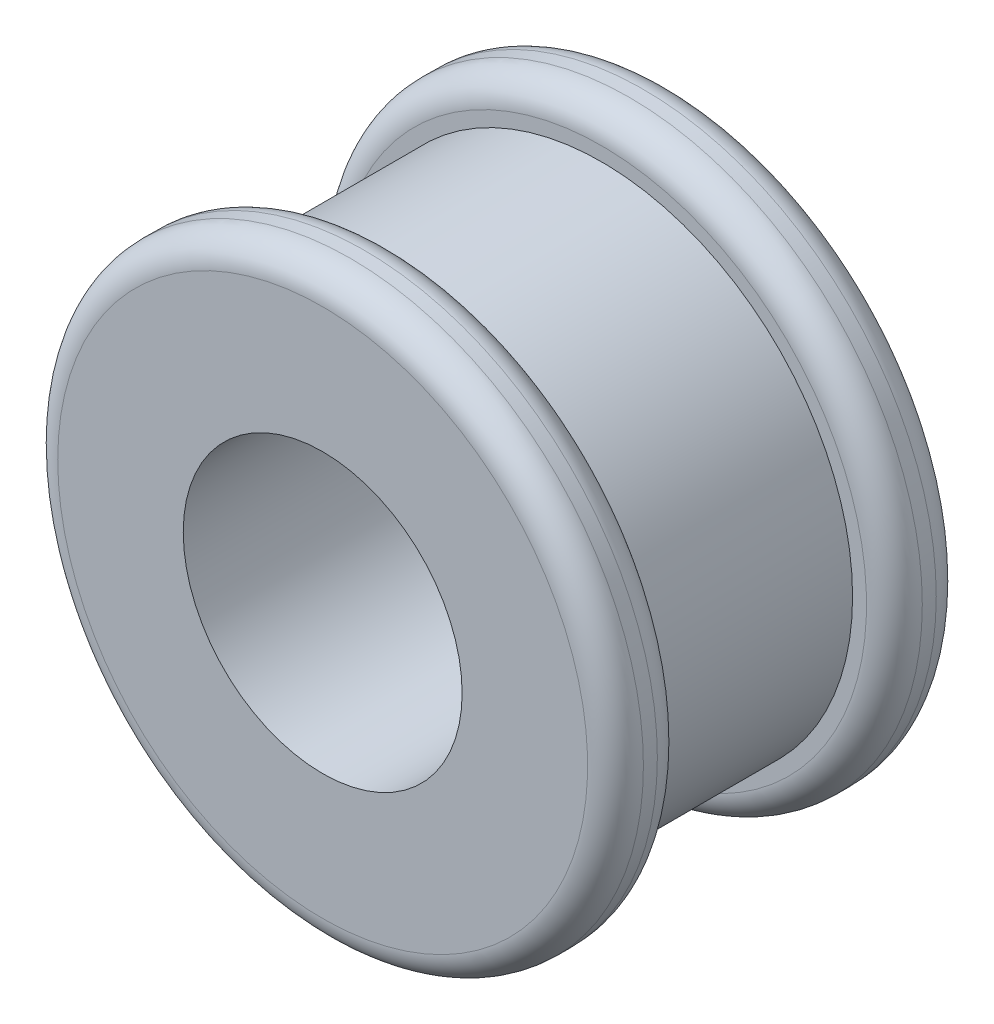
ISO-10303-21;
HEADER;
FILE_DESCRIPTION(('STEP AP214'),'2;1');
FILE_NAME('part.step','',(''),(''),'','','');
FILE_SCHEMA(('AUTOMOTIVE_DESIGN { 1 0 10303 214 1 1 1 1 }'));
ENDSEC;
DATA;
#1=APPLICATION_CONTEXT('core data for automotive mechanical design processes');
#2=APPLICATION_PROTOCOL_DEFINITION('international standard','automotive_design',2000,#1);
#3=PRODUCT_CONTEXT('',#1,'mechanical');
#4=PRODUCT('Part','Part','',(#3));
#5=PRODUCT_RELATED_PRODUCT_CATEGORY('part','',(#4));
#6=PRODUCT_DEFINITION_FORMATION('','',#4);
#7=PRODUCT_DEFINITION_CONTEXT('part definition',#1,'design');
#8=PRODUCT_DEFINITION('design','',#6,#7);
#9=PRODUCT_DEFINITION_SHAPE('','',#8);
#10=(LENGTH_UNIT() NAMED_UNIT(*) SI_UNIT(.MILLI.,.METRE.));
#11=(NAMED_UNIT(*) PLANE_ANGLE_UNIT() SI_UNIT($,.RADIAN.));
#12=(NAMED_UNIT(*) SI_UNIT($,.STERADIAN.) SOLID_ANGLE_UNIT());
#13=UNCERTAINTY_MEASURE_WITH_UNIT(LENGTH_MEASURE(1.E-05),#10,'distance_accuracy_value','');
#14=(GEOMETRIC_REPRESENTATION_CONTEXT(3) GLOBAL_UNCERTAINTY_ASSIGNED_CONTEXT((#13)) GLOBAL_UNIT_ASSIGNED_CONTEXT((#10,
#11,#12)) REPRESENTATION_CONTEXT('',''));
#15=CARTESIAN_POINT('',(0.,0.,0.));
#16=DIRECTION('',(0.,0.,1.));
#17=DIRECTION('',(1.,0.,0.));
#18=AXIS2_PLACEMENT_3D('',#15,#16,#17);
#19=CARTESIAN_POINT('',(0.,21.,0.));
#20=DIRECTION('',(0.,0.,-1.));
#21=DIRECTION('',(-1.,0.,0.));
#22=AXIS2_PLACEMENT_3D('',#19,#20,#21);
#23=PLANE('',#22);
#24=CARTESIAN_POINT('',(0.,0.,0.));
#25=DIRECTION('',(0.,0.,-1.));
#26=DIRECTION('',(-1.,0.,0.));
#27=AXIS2_PLACEMENT_3D('',#24,#25,#26);
#28=CIRCLE('',#27,19.);
#29=CARTESIAN_POINT('',(-19.,0.,0.));
#30=VERTEX_POINT('',#29);
#31=EDGE_CURVE('E10',#30,#30,#28,.F.);
#32=ORIENTED_EDGE('',*,*,#31,.T.);
#33=EDGE_LOOP('',(#32));
#34=FACE_BOUND('',#33,.T.);
#35=CARTESIAN_POINT('',(0.,0.,0.));
#36=DIRECTION('',(0.,0.,1.));
#37=DIRECTION('',(1.,0.,0.));
#38=AXIS2_PLACEMENT_3D('',#35,#36,#37);
#39=CIRCLE('',#38,10.);
#40=CARTESIAN_POINT('',(10.,0.,0.));
#41=VERTEX_POINT('',#40);
#42=EDGE_CURVE('E72',#41,#41,#39,.T.);
#43=ORIENTED_EDGE('',*,*,#42,.F.);
#44=EDGE_LOOP('',(#43));
#45=FACE_BOUND('',#44,.T.);
#46=ADVANCED_FACE('F40',(#34,#45),#23,.F.);
#47=CARTESIAN_POINT('',(0.,0.,0.));
#48=DIRECTION('',(0.,0.,1.));
#49=DIRECTION('',(1.,0.,0.));
#50=AXIS2_PLACEMENT_3D('',#47,#48,#49);
#51=CYLINDRICAL_SURFACE('',#50,10.);
#52=CARTESIAN_POINT('',(0.,0.,-25.));
#53=DIRECTION('',(0.,0.,1.));
#54=DIRECTION('',(1.,0.,0.));
#55=AXIS2_PLACEMENT_3D('',#52,#53,#54);
#56=CIRCLE('',#55,10.);
#57=CARTESIAN_POINT('',(10.,0.,-25.));
#58=VERTEX_POINT('',#57);
#59=EDGE_CURVE('E75',#58,#58,#56,.T.);
#60=ORIENTED_EDGE('',*,*,#59,.F.);
#61=EDGE_LOOP('',(#60));
#62=FACE_BOUND('',#61,.T.);
#63=ORIENTED_EDGE('',*,*,#42,.T.);
#64=EDGE_LOOP('',(#63));
#65=FACE_BOUND('',#64,.T.);
#66=ADVANCED_FACE('F105',(#62,#65),#51,.F.);
#67=CARTESIAN_POINT('',(0.,10.,-25.));
#68=DIRECTION('',(0.,0.,1.));
#69=DIRECTION('',(1.,0.,0.));
#70=AXIS2_PLACEMENT_3D('',#67,#68,#69);
#71=PLANE('',#70);
#72=CARTESIAN_POINT('',(0.,0.,-25.));
#73=DIRECTION('',(0.,0.,1.));
#74=DIRECTION('',(1.,0.,0.));
#75=AXIS2_PLACEMENT_3D('',#72,#73,#74);
#76=CIRCLE('',#75,19.);
#77=CARTESIAN_POINT('',(19.,0.,-25.));
#78=VERTEX_POINT('',#77);
#79=EDGE_CURVE('E63',#78,#78,#76,.F.);
#80=ORIENTED_EDGE('',*,*,#79,.T.);
#81=EDGE_LOOP('',(#80));
#82=FACE_BOUND('',#81,.T.);
#83=ORIENTED_EDGE('',*,*,#59,.T.);
#84=EDGE_LOOP('',(#83));
#85=FACE_BOUND('',#84,.T.);
#86=ADVANCED_FACE('F101',(#82,#85),#71,.F.);
#87=CARTESIAN_POINT('',(0.,0.,0.));
#88=DIRECTION('',(0.,0.,1.));
#89=DIRECTION('',(1.,0.,0.));
#90=AXIS2_PLACEMENT_3D('',#87,#88,#89);
#91=CYLINDRICAL_SURFACE('',#90,21.);
#92=CARTESIAN_POINT('',(0.,0.,-23.));
#93=DIRECTION('',(0.,0.,1.));
#94=DIRECTION('',(1.,0.,0.));
#95=AXIS2_PLACEMENT_3D('',#92,#93,#94);
#96=CIRCLE('',#95,21.);
#97=CARTESIAN_POINT('',(21.,0.,-23.));
#98=VERTEX_POINT('',#97);
#99=EDGE_CURVE('E66',#98,#98,#96,.T.);
#100=ORIENTED_EDGE('',*,*,#99,.T.);
#101=EDGE_LOOP('',(#100));
#102=FACE_BOUND('',#101,.T.);
#103=CARTESIAN_POINT('',(0.,0.,-22.));
#104=DIRECTION('',(0.,0.,-1.));
#105=DIRECTION('',(-1.,0.,0.));
#106=AXIS2_PLACEMENT_3D('',#103,#104,#105);
#107=CIRCLE('',#106,21.);
#108=CARTESIAN_POINT('',(-21.,0.,-22.));
#109=VERTEX_POINT('',#108);
#110=EDGE_CURVE('E69',#109,#109,#107,.T.);
#111=ORIENTED_EDGE('',*,*,#110,.T.);
#112=EDGE_LOOP('',(#111));
#113=FACE_BOUND('',#112,.T.);
#114=ADVANCED_FACE('F95',(#102,#113),#91,.T.);
#115=CARTESIAN_POINT('',(0.,21.,-20.));
#116=DIRECTION('',(0.,0.,-1.));
#117=DIRECTION('',(-1.,0.,0.));
#118=AXIS2_PLACEMENT_3D('',#115,#116,#117);
#119=PLANE('',#118);
#120=CARTESIAN_POINT('',(0.,0.,-20.));
#121=DIRECTION('',(0.,0.,-1.));
#122=DIRECTION('',(-1.,0.,0.));
#123=AXIS2_PLACEMENT_3D('',#120,#121,#122);
#124=CIRCLE('',#123,19.);
#125=CARTESIAN_POINT('',(-19.,0.,-20.));
#126=VERTEX_POINT('',#125);
#127=EDGE_CURVE('E60',#126,#126,#124,.F.);
#128=ORIENTED_EDGE('',*,*,#127,.T.);
#129=EDGE_LOOP('',(#128));
#130=FACE_BOUND('',#129,.T.);
#131=CARTESIAN_POINT('',(0.,0.,-20.));
#132=DIRECTION('',(0.,0.,1.));
#133=DIRECTION('',(1.,0.,0.));
#134=AXIS2_PLACEMENT_3D('',#131,#132,#133);
#135=CIRCLE('',#134,18.);
#136=CARTESIAN_POINT('',(18.,0.,-20.));
#137=VERTEX_POINT('',#136);
#138=EDGE_CURVE('E78',#137,#137,#135,.T.);
#139=ORIENTED_EDGE('',*,*,#138,.F.);
#140=EDGE_LOOP('',(#139));
#141=FACE_BOUND('',#140,.T.);
#142=ADVANCED_FACE('F90',(#130,#141),#119,.F.);
#143=CARTESIAN_POINT('',(0.,0.,0.));
#144=DIRECTION('',(0.,0.,1.));
#145=DIRECTION('',(1.,0.,0.));
#146=AXIS2_PLACEMENT_3D('',#143,#144,#145);
#147=CYLINDRICAL_SURFACE('',#146,18.);
#148=CARTESIAN_POINT('',(0.,0.,-5.));
#149=DIRECTION('',(0.,0.,1.));
#150=DIRECTION('',(1.,0.,0.));
#151=AXIS2_PLACEMENT_3D('',#148,#149,#150);
#152=CIRCLE('',#151,18.);
#153=CARTESIAN_POINT('',(18.,0.,-5.));
#154=VERTEX_POINT('',#153);
#155=EDGE_CURVE('E81',#154,#154,#152,.T.);
#156=ORIENTED_EDGE('',*,*,#155,.F.);
#157=EDGE_LOOP('',(#156));
#158=FACE_BOUND('',#157,.T.);
#159=ORIENTED_EDGE('',*,*,#138,.T.);
#160=EDGE_LOOP('',(#159));
#161=FACE_BOUND('',#160,.T.);
#162=ADVANCED_FACE('F87',(#158,#161),#147,.T.);
#163=CARTESIAN_POINT('',(0.,18.,-5.));
#164=DIRECTION('',(0.,0.,1.));
#165=DIRECTION('',(1.,0.,0.));
#166=AXIS2_PLACEMENT_3D('',#163,#164,#165);
#167=PLANE('',#166);
#168=CARTESIAN_POINT('',(0.,0.,-5.));
#169=DIRECTION('',(0.,0.,1.));
#170=DIRECTION('',(1.,0.,0.));
#171=AXIS2_PLACEMENT_3D('',#168,#169,#170);
#172=CIRCLE('',#171,19.);
#173=CARTESIAN_POINT('',(19.,0.,-5.));
#174=VERTEX_POINT('',#173);
#175=EDGE_CURVE('E47',#174,#174,#172,.F.);
#176=ORIENTED_EDGE('',*,*,#175,.T.);
#177=EDGE_LOOP('',(#176));
#178=FACE_BOUND('',#177,.T.);
#179=ORIENTED_EDGE('',*,*,#155,.T.);
#180=EDGE_LOOP('',(#179));
#181=FACE_BOUND('',#180,.T.);
#182=ADVANCED_FACE('F85',(#178,#181),#167,.F.);
#183=CARTESIAN_POINT('',(0.,0.,0.));
#184=DIRECTION('',(0.,0.,1.));
#185=DIRECTION('',(1.,0.,0.));
#186=AXIS2_PLACEMENT_3D('',#183,#184,#185);
#187=CYLINDRICAL_SURFACE('',#186,21.);
#188=CARTESIAN_POINT('',(0.,0.,-3.));
#189=DIRECTION('',(0.,0.,1.));
#190=DIRECTION('',(1.,0.,0.));
#191=AXIS2_PLACEMENT_3D('',#188,#189,#190);
#192=CIRCLE('',#191,21.);
#193=CARTESIAN_POINT('',(21.,0.,-3.));
#194=VERTEX_POINT('',#193);
#195=EDGE_CURVE('E51',#194,#194,#192,.T.);
#196=ORIENTED_EDGE('',*,*,#195,.T.);
#197=EDGE_LOOP('',(#196));
#198=FACE_BOUND('',#197,.T.);
#199=CARTESIAN_POINT('',(0.,0.,-2.));
#200=DIRECTION('',(0.,0.,-1.));
#201=DIRECTION('',(-1.,0.,0.));
#202=AXIS2_PLACEMENT_3D('',#199,#200,#201);
#203=CIRCLE('',#202,21.);
#204=CARTESIAN_POINT('',(-21.,0.,-2.));
#205=VERTEX_POINT('',#204);
#206=EDGE_CURVE('E55',#205,#205,#203,.T.);
#207=ORIENTED_EDGE('',*,*,#206,.T.);
#208=EDGE_LOOP('',(#207));
#209=FACE_BOUND('',#208,.T.);
#210=ADVANCED_FACE('F119',(#198,#209),#187,.T.);
#211=CARTESIAN_POINT('',(0.,0.,-23.));
#212=DIRECTION('',(0.,0.,1.));
#213=DIRECTION('',(1.,0.,0.));
#214=AXIS2_PLACEMENT_3D('',#211,#212,#213);
#215=TOROIDAL_SURFACE('',#214,19.,2.);
#216=ORIENTED_EDGE('',*,*,#79,.F.);
#217=EDGE_LOOP('',(#216));
#218=FACE_BOUND('',#217,.T.);
#219=ORIENTED_EDGE('',*,*,#99,.F.);
#220=EDGE_LOOP('',(#219));
#221=FACE_BOUND('',#220,.T.);
#222=ADVANCED_FACE('F115',(#218,#221),#215,.T.);
#223=CARTESIAN_POINT('',(0.,0.,-22.));
#224=DIRECTION('',(0.,0.,-1.));
#225=DIRECTION('',(-1.,0.,0.));
#226=AXIS2_PLACEMENT_3D('',#223,#224,#225);
#227=TOROIDAL_SURFACE('',#226,19.,2.);
#228=ORIENTED_EDGE('',*,*,#110,.F.);
#229=EDGE_LOOP('',(#228));
#230=FACE_BOUND('',#229,.T.);
#231=ORIENTED_EDGE('',*,*,#127,.F.);
#232=EDGE_LOOP('',(#231));
#233=FACE_BOUND('',#232,.T.);
#234=ADVANCED_FACE('F118',(#230,#233),#227,.T.);
#235=CARTESIAN_POINT('',(0.,0.,-3.));
#236=DIRECTION('',(0.,0.,1.));
#237=DIRECTION('',(1.,0.,0.));
#238=AXIS2_PLACEMENT_3D('',#235,#236,#237);
#239=TOROIDAL_SURFACE('',#238,19.,2.);
#240=ORIENTED_EDGE('',*,*,#175,.F.);
#241=EDGE_LOOP('',(#240));
#242=FACE_BOUND('',#241,.T.);
#243=ORIENTED_EDGE('',*,*,#195,.F.);
#244=EDGE_LOOP('',(#243));
#245=FACE_BOUND('',#244,.T.);
#246=ADVANCED_FACE('F122',(#242,#245),#239,.T.);
#247=CARTESIAN_POINT('',(0.,0.,-2.));
#248=DIRECTION('',(0.,0.,-1.));
#249=DIRECTION('',(-1.,0.,0.));
#250=AXIS2_PLACEMENT_3D('',#247,#248,#249);
#251=TOROIDAL_SURFACE('',#250,19.,2.);
#252=ORIENTED_EDGE('',*,*,#206,.F.);
#253=EDGE_LOOP('',(#252));
#254=FACE_BOUND('',#253,.T.);
#255=ORIENTED_EDGE('',*,*,#31,.F.);
#256=EDGE_LOOP('',(#255));
#257=FACE_BOUND('',#256,.T.);
#258=ADVANCED_FACE('F42',(#254,#257),#251,.T.);
#259=CLOSED_SHELL('',(#46,#66,#86,#114,#142,#162,#182,#210,#222,#234,#246,#258));
#260=MANIFOLD_SOLID_BREP('B2',#259);
#261=ADVANCED_BREP_SHAPE_REPRESENTATION('',(#18,#260),#14);
#262=SHAPE_DEFINITION_REPRESENTATION(#9,#261);
ENDSEC;
END-ISO-10303-21;
